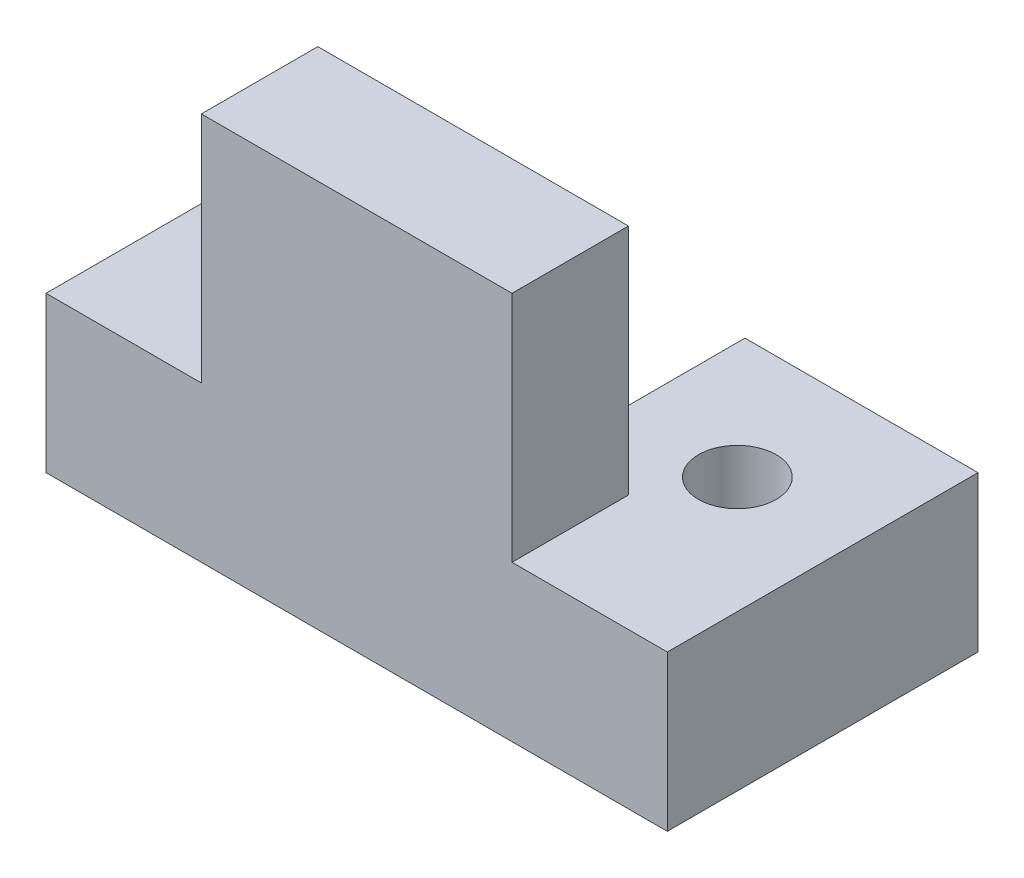
ISO-10303-21;
HEADER;
FILE_DESCRIPTION(('STEP AP214'),'2;1');
FILE_NAME('part.step','',(''),(''),'','','');
FILE_SCHEMA(('AUTOMOTIVE_DESIGN { 1 0 10303 214 1 1 1 1 }'));
ENDSEC;
DATA;
#1=APPLICATION_CONTEXT('core data for automotive mechanical design processes');
#2=APPLICATION_PROTOCOL_DEFINITION('international standard','automotive_design',2000,#1);
#3=PRODUCT_CONTEXT('',#1,'mechanical');
#4=PRODUCT('Part','Part','',(#3));
#5=PRODUCT_RELATED_PRODUCT_CATEGORY('part','',(#4));
#6=PRODUCT_DEFINITION_FORMATION('','',#4);
#7=PRODUCT_DEFINITION_CONTEXT('part definition',#1,'design');
#8=PRODUCT_DEFINITION('design','',#6,#7);
#9=PRODUCT_DEFINITION_SHAPE('','',#8);
#10=(LENGTH_UNIT() NAMED_UNIT(*) SI_UNIT(.MILLI.,.METRE.));
#11=(NAMED_UNIT(*) PLANE_ANGLE_UNIT() SI_UNIT($,.RADIAN.));
#12=(NAMED_UNIT(*) SI_UNIT($,.STERADIAN.) SOLID_ANGLE_UNIT());
#13=UNCERTAINTY_MEASURE_WITH_UNIT(LENGTH_MEASURE(1.E-05),#10,'distance_accuracy_value','');
#14=(GEOMETRIC_REPRESENTATION_CONTEXT(3) GLOBAL_UNCERTAINTY_ASSIGNED_CONTEXT((#13)) GLOBAL_UNIT_ASSIGNED_CONTEXT((#10,
#11,#12)) REPRESENTATION_CONTEXT('',''));
#15=CARTESIAN_POINT('',(0.,0.,0.));
#16=DIRECTION('',(0.,0.,1.));
#17=DIRECTION('',(1.,0.,0.));
#18=AXIS2_PLACEMENT_3D('',#15,#16,#17);
#19=CARTESIAN_POINT('',(-58.487438986932,25.4,-105.057257193932));
#20=DIRECTION('',(0.,0.,1.));
#21=DIRECTION('',(1.,0.,0.));
#22=AXIS2_PLACEMENT_3D('',#19,#20,#21);
#23=PLANE('',#22);
#24=DIRECTION('',(-1.,0.,0.));
#25=VECTOR('',#24,1.);
#26=CARTESIAN_POINT('',(-58.487438986932,0.,-105.057257193932));
#27=LINE('',#26,#25);
#28=CARTESIAN_POINT('',(43.112561013068,0.,-105.057257193932));
#29=VERTEX_POINT('',#28);
#30=CARTESIAN_POINT('',(5.01256101306804,0.,-105.057257193932));
#31=VERTEX_POINT('',#30);
#32=EDGE_CURVE('E193',#29,#31,#27,.T.);
#33=ORIENTED_EDGE('',*,*,#32,.T.);
#34=DIRECTION('',(0.,1.,0.));
#35=VECTOR('',#34,1.);
#36=CARTESIAN_POINT('',(5.01256101306804,0.,-105.057257193932));
#37=LINE('',#36,#35);
#38=CARTESIAN_POINT('',(5.01256101306804,25.4,-105.057257193932));
#39=VERTEX_POINT('',#38);
#40=EDGE_CURVE('E161',#31,#39,#37,.T.);
#41=ORIENTED_EDGE('',*,*,#40,.T.);
#42=DIRECTION('',(-1.,0.,0.));
#43=VECTOR('',#42,1.);
#44=CARTESIAN_POINT('',(-58.487438986932,25.4,-105.057257193932));
#45=LINE('',#44,#43);
#46=CARTESIAN_POINT('',(43.112561013068,25.4,-105.057257193932));
#47=VERTEX_POINT('',#46);
#48=EDGE_CURVE('E181',#47,#39,#45,.T.);
#49=ORIENTED_EDGE('',*,*,#48,.F.);
#50=DIRECTION('',(0.,-1.,0.));
#51=VECTOR('',#50,1.);
#52=CARTESIAN_POINT('',(43.112561013068,25.4,-105.057257193932));
#53=LINE('',#52,#51);
#54=EDGE_CURVE('E11',#47,#29,#53,.T.);
#55=ORIENTED_EDGE('',*,*,#54,.T.);
#56=EDGE_LOOP('',(#33,#41,#49,#55));
#57=FACE_BOUND('',#56,.T.);
#58=ADVANCED_FACE('F33',(#57),#23,.F.);
#59=CARTESIAN_POINT('',(43.112561013068,25.4,-105.057257193932));
#60=DIRECTION('',(-1.,0.,0.));
#61=DIRECTION('',(0.,0.,1.));
#62=AXIS2_PLACEMENT_3D('',#59,#60,#61);
#63=PLANE('',#62);
#64=DIRECTION('',(0.,0.,-1.));
#65=VECTOR('',#64,1.);
#66=CARTESIAN_POINT('',(43.112561013068,0.,-105.057257193932));
#67=LINE('',#66,#65);
#68=CARTESIAN_POINT('',(43.112561013068,0.,-54.2572571939323));
#69=VERTEX_POINT('',#68);
#70=EDGE_CURVE('E169',#69,#29,#67,.T.);
#71=ORIENTED_EDGE('',*,*,#70,.T.);
#72=ORIENTED_EDGE('',*,*,#54,.F.);
#73=DIRECTION('',(0.,0.,-1.));
#74=VECTOR('',#73,1.);
#75=CARTESIAN_POINT('',(43.112561013068,25.4,-105.057257193932));
#76=LINE('',#75,#74);
#77=CARTESIAN_POINT('',(43.112561013068,25.4,-54.2572571939323));
#78=VERTEX_POINT('',#77);
#79=EDGE_CURVE('E176',#78,#47,#76,.T.);
#80=ORIENTED_EDGE('',*,*,#79,.F.);
#81=DIRECTION('',(0.,-1.,0.));
#82=VECTOR('',#81,1.);
#83=CARTESIAN_POINT('',(43.112561013068,25.4,-54.2572571939323));
#84=LINE('',#83,#82);
#85=EDGE_CURVE('E189',#78,#69,#84,.T.);
#86=ORIENTED_EDGE('',*,*,#85,.T.);
#87=EDGE_LOOP('',(#71,#72,#80,#86));
#88=FACE_BOUND('',#87,.T.);
#89=ADVANCED_FACE('F35',(#88),#63,.F.);
#90=CARTESIAN_POINT('',(-20.387438986932,25.4,-105.057257193932));
#91=VERTEX_POINT('',#90);
#92=CARTESIAN_POINT('',(-58.487438986932,25.4,-105.057257193932));
#93=VERTEX_POINT('',#92);
#94=EDGE_CURVE('E179',#91,#93,#45,.T.);
#95=ORIENTED_EDGE('',*,*,#94,.F.);
#96=DIRECTION('',(0.,1.,0.));
#97=VECTOR('',#96,1.);
#98=CARTESIAN_POINT('',(-20.387438986932,0.,-105.057257193932));
#99=LINE('',#98,#97);
#100=CARTESIAN_POINT('',(-20.387438986932,0.,-105.057257193932));
#101=VERTEX_POINT('',#100);
#102=EDGE_CURVE('E172',#101,#91,#99,.T.);
#103=ORIENTED_EDGE('',*,*,#102,.F.);
#104=CARTESIAN_POINT('',(-58.487438986932,0.,-105.057257193932));
#105=VERTEX_POINT('',#104);
#106=EDGE_CURVE('E192',#101,#105,#27,.T.);
#107=ORIENTED_EDGE('',*,*,#106,.T.);
#108=DIRECTION('',(0.,-1.,0.));
#109=VECTOR('',#108,1.);
#110=CARTESIAN_POINT('',(-58.487438986932,25.4,-105.057257193932));
#111=LINE('',#110,#109);
#112=EDGE_CURVE('E41',#93,#105,#111,.T.);
#113=ORIENTED_EDGE('',*,*,#112,.F.);
#114=EDGE_LOOP('',(#95,#103,#107,#113));
#115=FACE_BOUND('',#114,.T.);
#116=ADVANCED_FACE('F248',(#115),#23,.F.);
#117=CARTESIAN_POINT('',(-58.487438986932,25.4,-105.057257193932));
#118=DIRECTION('',(1.,0.,0.));
#119=DIRECTION('',(0.,0.,-1.));
#120=AXIS2_PLACEMENT_3D('',#117,#118,#119);
#121=PLANE('',#120);
#122=DIRECTION('',(0.,0.,1.));
#123=VECTOR('',#122,1.);
#124=CARTESIAN_POINT('',(-58.487438986932,0.,-105.057257193932));
#125=LINE('',#124,#123);
#126=CARTESIAN_POINT('',(-58.487438986932,0.,-54.2572571939323));
#127=VERTEX_POINT('',#126);
#128=EDGE_CURVE('E196',#105,#127,#125,.T.);
#129=ORIENTED_EDGE('',*,*,#128,.T.);
#130=DIRECTION('',(0.,-1.,0.));
#131=VECTOR('',#130,1.);
#132=CARTESIAN_POINT('',(-58.487438986932,25.4,-54.2572571939323));
#133=LINE('',#132,#131);
#134=CARTESIAN_POINT('',(-58.487438986932,25.4,-54.2572571939323));
#135=VERTEX_POINT('',#134);
#136=EDGE_CURVE('E201',#135,#127,#133,.T.);
#137=ORIENTED_EDGE('',*,*,#136,.F.);
#138=DIRECTION('',(0.,0.,1.));
#139=VECTOR('',#138,1.);
#140=CARTESIAN_POINT('',(-58.487438986932,25.4,-105.057257193932));
#141=LINE('',#140,#139);
#142=EDGE_CURVE('E184',#93,#135,#141,.T.);
#143=ORIENTED_EDGE('',*,*,#142,.F.);
#144=ORIENTED_EDGE('',*,*,#112,.T.);
#145=EDGE_LOOP('',(#129,#137,#143,#144));
#146=FACE_BOUND('',#145,.T.);
#147=ADVANCED_FACE('F208',(#146),#121,.F.);
#148=CARTESIAN_POINT('',(-58.487438986932,25.4,-54.2572571939323));
#149=DIRECTION('',(0.,0.,-1.));
#150=DIRECTION('',(-1.,0.,0.));
#151=AXIS2_PLACEMENT_3D('',#148,#149,#150);
#152=PLANE('',#151);
#153=DIRECTION('',(1.,0.,0.));
#154=VECTOR('',#153,1.);
#155=CARTESIAN_POINT('',(-58.487438986932,0.,-54.2572571939323));
#156=LINE('',#155,#154);
#157=EDGE_CURVE('E180',#127,#69,#156,.T.);
#158=ORIENTED_EDGE('',*,*,#157,.T.);
#159=ORIENTED_EDGE('',*,*,#85,.F.);
#160=DIRECTION('',(1.,0.,0.));
#161=VECTOR('',#160,1.);
#162=CARTESIAN_POINT('',(-58.487438986932,25.4,-54.2572571939323));
#163=LINE('',#162,#161);
#164=CARTESIAN_POINT('',(17.712561013068,25.4,-54.2572571939323));
#165=VERTEX_POINT('',#164);
#166=EDGE_CURVE('E186',#165,#78,#163,.T.);
#167=ORIENTED_EDGE('',*,*,#166,.F.);
#168=DIRECTION('',(0.,-1.,0.));
#169=VECTOR('',#168,1.);
#170=CARTESIAN_POINT('',(17.712561013068,63.5,-54.2572571939323));
#171=LINE('',#170,#169);
#172=CARTESIAN_POINT('',(17.712561013068,63.5,-54.2572571939323));
#173=VERTEX_POINT('',#172);
#174=EDGE_CURVE('E128',#173,#165,#171,.T.);
#175=ORIENTED_EDGE('',*,*,#174,.F.);
#176=DIRECTION('',(1.,0.,0.));
#177=VECTOR('',#176,1.);
#178=CARTESIAN_POINT('',(-33.087438986932,63.5,-54.2572571939323));
#179=LINE('',#178,#177);
#180=CARTESIAN_POINT('',(-33.087438986932,63.5,-54.2572571939323));
#181=VERTEX_POINT('',#180);
#182=EDGE_CURVE('E121',#181,#173,#179,.T.);
#183=ORIENTED_EDGE('',*,*,#182,.F.);
#184=DIRECTION('',(0.,-1.,0.));
#185=VECTOR('',#184,1.);
#186=CARTESIAN_POINT('',(-33.087438986932,63.5,-54.2572571939323));
#187=LINE('',#186,#185);
#188=CARTESIAN_POINT('',(-33.087438986932,25.4,-54.2572571939323));
#189=VERTEX_POINT('',#188);
#190=EDGE_CURVE('E126',#181,#189,#187,.T.);
#191=ORIENTED_EDGE('',*,*,#190,.T.);
#192=EDGE_CURVE('E187',#135,#189,#163,.T.);
#193=ORIENTED_EDGE('',*,*,#192,.F.);
#194=ORIENTED_EDGE('',*,*,#136,.T.);
#195=EDGE_LOOP('',(#158,#159,#167,#175,#183,#191,#193,#194));
#196=FACE_BOUND('',#195,.T.);
#197=ADVANCED_FACE('F123',(#196),#152,.F.);
#198=CARTESIAN_POINT('',(0.,25.4,0.));
#199=DIRECTION('',(0.,1.,0.));
#200=DIRECTION('',(0.,0.,1.));
#201=AXIS2_PLACEMENT_3D('',#198,#199,#200);
#202=PLANE('',#201);
#203=CARTESIAN_POINT('',(24.062561013068,25.4,-84.7557021013472));
#204=DIRECTION('',(0.,1.,0.));
#205=DIRECTION('',(0.,0.,1.));
#206=AXIS2_PLACEMENT_3D('',#203,#204,#205);
#207=CIRCLE('',#206,6.35);
#208=CARTESIAN_POINT('',(24.062561013068,25.4,-78.4057021013472));
#209=VERTEX_POINT('',#208);
#210=EDGE_CURVE('E379',#209,#209,#207,.T.);
#211=ORIENTED_EDGE('',*,*,#210,.F.);
#212=EDGE_LOOP('',(#211));
#213=FACE_BOUND('',#212,.T.);
#214=DIRECTION('',(0.,0.,1.));
#215=VECTOR('',#214,1.);
#216=CARTESIAN_POINT('',(-33.087438986932,25.4,-73.3072571939323));
#217=LINE('',#216,#215);
#218=CARTESIAN_POINT('',(-33.087438986932,25.4,-73.3072571939323));
#219=VERTEX_POINT('',#218);
#220=EDGE_CURVE('E48',#219,#189,#217,.T.);
#221=ORIENTED_EDGE('',*,*,#220,.F.);
#222=DIRECTION('',(-1.,0.,0.));
#223=VECTOR('',#222,1.);
#224=CARTESIAN_POINT('',(-33.087438986932,25.4,-73.3072571939323));
#225=LINE('',#224,#223);
#226=CARTESIAN_POINT('',(17.712561013068,25.4,-73.3072571939323));
#227=VERTEX_POINT('',#226);
#228=EDGE_CURVE('E141',#227,#219,#225,.T.);
#229=ORIENTED_EDGE('',*,*,#228,.F.);
#230=DIRECTION('',(0.,0.,-1.));
#231=VECTOR('',#230,1.);
#232=CARTESIAN_POINT('',(17.712561013068,25.4,-73.3072571939323));
#233=LINE('',#232,#231);
#234=EDGE_CURVE('E54',#165,#227,#233,.T.);
#235=ORIENTED_EDGE('',*,*,#234,.F.);
#236=ORIENTED_EDGE('',*,*,#166,.T.);
#237=ORIENTED_EDGE('',*,*,#79,.T.);
#238=ORIENTED_EDGE('',*,*,#48,.T.);
#239=DIRECTION('',(0.,0.,-1.));
#240=VECTOR('',#239,1.);
#241=CARTESIAN_POINT('',(5.01256101306804,25.4,-105.057257193932));
#242=LINE('',#241,#240);
#243=CARTESIAN_POINT('',(5.01256101306804,25.4,-86.0072571939323));
#244=VERTEX_POINT('',#243);
#245=EDGE_CURVE('E144',#244,#39,#242,.T.);
#246=ORIENTED_EDGE('',*,*,#245,.F.);
#247=DIRECTION('',(1.,0.,0.));
#248=VECTOR('',#247,1.);
#249=CARTESIAN_POINT('',(-20.387438986932,25.4,-86.0072571939323));
#250=LINE('',#249,#248);
#251=CARTESIAN_POINT('',(-20.387438986932,25.4,-86.0072571939323));
#252=VERTEX_POINT('',#251);
#253=EDGE_CURVE('E156',#252,#244,#250,.T.);
#254=ORIENTED_EDGE('',*,*,#253,.F.);
#255=DIRECTION('',(0.,0.,1.));
#256=VECTOR('',#255,1.);
#257=CARTESIAN_POINT('',(-20.387438986932,25.4,-105.057257193932));
#258=LINE('',#257,#256);
#259=EDGE_CURVE('E146',#91,#252,#258,.T.);
#260=ORIENTED_EDGE('',*,*,#259,.F.);
#261=ORIENTED_EDGE('',*,*,#94,.T.);
#262=ORIENTED_EDGE('',*,*,#142,.T.);
#263=ORIENTED_EDGE('',*,*,#192,.T.);
#264=EDGE_LOOP('',(#221,#229,#235,#236,#237,#238,#246,#254,#260,#261,#262,#263));
#265=FACE_BOUND('',#264,.T.);
#266=ADVANCED_FACE('F221',(#213,#265),#202,.T.);
#267=CARTESIAN_POINT('',(0.,0.,0.));
#268=DIRECTION('',(0.,1.,0.));
#269=DIRECTION('',(0.,0.,1.));
#270=AXIS2_PLACEMENT_3D('',#267,#268,#269);
#271=PLANE('',#270);
#272=CARTESIAN_POINT('',(24.062561013068,0.,-84.7557021013472));
#273=DIRECTION('',(0.,1.,0.));
#274=DIRECTION('',(0.,0.,1.));
#275=AXIS2_PLACEMENT_3D('',#272,#273,#274);
#276=CIRCLE('',#275,6.35);
#277=CARTESIAN_POINT('',(24.062561013068,0.,-78.4057021013472));
#278=VERTEX_POINT('',#277);
#279=EDGE_CURVE('E232',#278,#278,#276,.T.);
#280=ORIENTED_EDGE('',*,*,#279,.T.);
#281=EDGE_LOOP('',(#280));
#282=FACE_BOUND('',#281,.T.);
#283=DIRECTION('',(1.,0.,0.));
#284=VECTOR('',#283,1.);
#285=CARTESIAN_POINT('',(-20.387438986932,0.,-86.0072571939323));
#286=LINE('',#285,#284);
#287=CARTESIAN_POINT('',(-20.387438986932,0.,-86.0072571939323));
#288=VERTEX_POINT('',#287);
#289=CARTESIAN_POINT('',(5.01256101306804,0.,-86.0072571939323));
#290=VERTEX_POINT('',#289);
#291=EDGE_CURVE('E159',#288,#290,#286,.T.);
#292=ORIENTED_EDGE('',*,*,#291,.T.);
#293=DIRECTION('',(0.,0.,-1.));
#294=VECTOR('',#293,1.);
#295=CARTESIAN_POINT('',(5.01256101306804,0.,-105.057257193932));
#296=LINE('',#295,#294);
#297=EDGE_CURVE('E152',#290,#31,#296,.T.);
#298=ORIENTED_EDGE('',*,*,#297,.T.);
#299=ORIENTED_EDGE('',*,*,#32,.F.);
#300=ORIENTED_EDGE('',*,*,#70,.F.);
#301=ORIENTED_EDGE('',*,*,#157,.F.);
#302=ORIENTED_EDGE('',*,*,#128,.F.);
#303=ORIENTED_EDGE('',*,*,#106,.F.);
#304=DIRECTION('',(0.,0.,1.));
#305=VECTOR('',#304,1.);
#306=CARTESIAN_POINT('',(-20.387438986932,0.,-105.057257193932));
#307=LINE('',#306,#305);
#308=EDGE_CURVE('E155',#101,#288,#307,.T.);
#309=ORIENTED_EDGE('',*,*,#308,.T.);
#310=EDGE_LOOP('',(#292,#298,#299,#300,#301,#302,#303,#309));
#311=FACE_BOUND('',#310,.T.);
#312=ADVANCED_FACE('F215',(#282,#311),#271,.F.);
#313=CARTESIAN_POINT('',(5.01256101306804,0.,-105.057257193932));
#314=DIRECTION('',(1.,0.,0.));
#315=DIRECTION('',(0.,0.,-1.));
#316=AXIS2_PLACEMENT_3D('',#313,#314,#315);
#317=PLANE('',#316);
#318=ORIENTED_EDGE('',*,*,#245,.T.);
#319=ORIENTED_EDGE('',*,*,#40,.F.);
#320=ORIENTED_EDGE('',*,*,#297,.F.);
#321=DIRECTION('',(0.,1.,0.));
#322=VECTOR('',#321,1.);
#323=CARTESIAN_POINT('',(5.01256101306804,0.,-86.0072571939323));
#324=LINE('',#323,#322);
#325=EDGE_CURVE('E167',#290,#244,#324,.T.);
#326=ORIENTED_EDGE('',*,*,#325,.T.);
#327=EDGE_LOOP('',(#318,#319,#320,#326));
#328=FACE_BOUND('',#327,.T.);
#329=ADVANCED_FACE('F267',(#328),#317,.F.);
#330=CARTESIAN_POINT('',(-20.387438986932,0.,-86.0072571939323));
#331=DIRECTION('',(0.,0.,1.));
#332=DIRECTION('',(1.,0.,0.));
#333=AXIS2_PLACEMENT_3D('',#330,#331,#332);
#334=PLANE('',#333);
#335=ORIENTED_EDGE('',*,*,#253,.T.);
#336=ORIENTED_EDGE('',*,*,#325,.F.);
#337=ORIENTED_EDGE('',*,*,#291,.F.);
#338=DIRECTION('',(0.,1.,0.));
#339=VECTOR('',#338,1.);
#340=CARTESIAN_POINT('',(-20.387438986932,0.,-86.0072571939323));
#341=LINE('',#340,#339);
#342=EDGE_CURVE('E170',#288,#252,#341,.T.);
#343=ORIENTED_EDGE('',*,*,#342,.T.);
#344=EDGE_LOOP('',(#335,#336,#337,#343));
#345=FACE_BOUND('',#344,.T.);
#346=ADVANCED_FACE('F265',(#345),#334,.F.);
#347=CARTESIAN_POINT('',(-20.387438986932,0.,-105.057257193932));
#348=DIRECTION('',(-1.,0.,0.));
#349=DIRECTION('',(0.,0.,1.));
#350=AXIS2_PLACEMENT_3D('',#347,#348,#349);
#351=PLANE('',#350);
#352=ORIENTED_EDGE('',*,*,#259,.T.);
#353=ORIENTED_EDGE('',*,*,#342,.F.);
#354=ORIENTED_EDGE('',*,*,#308,.F.);
#355=ORIENTED_EDGE('',*,*,#102,.T.);
#356=EDGE_LOOP('',(#352,#353,#354,#355));
#357=FACE_BOUND('',#356,.T.);
#358=ADVANCED_FACE('F262',(#357),#351,.F.);
#359=CARTESIAN_POINT('',(-33.087438986932,63.5,-73.3072571939323));
#360=DIRECTION('',(1.,0.,0.));
#361=DIRECTION('',(0.,0.,-1.));
#362=AXIS2_PLACEMENT_3D('',#359,#360,#361);
#363=PLANE('',#362);
#364=ORIENTED_EDGE('',*,*,#220,.T.);
#365=ORIENTED_EDGE('',*,*,#190,.F.);
#366=DIRECTION('',(0.,0.,1.));
#367=VECTOR('',#366,1.);
#368=CARTESIAN_POINT('',(-33.087438986932,63.5,-73.3072571939323));
#369=LINE('',#368,#367);
#370=CARTESIAN_POINT('',(-33.087438986932,63.5,-73.3072571939323));
#371=VERTEX_POINT('',#370);
#372=EDGE_CURVE('E132',#371,#181,#369,.T.);
#373=ORIENTED_EDGE('',*,*,#372,.F.);
#374=DIRECTION('',(0.,-1.,0.));
#375=VECTOR('',#374,1.);
#376=CARTESIAN_POINT('',(-33.087438986932,63.5,-73.3072571939323));
#377=LINE('',#376,#375);
#378=EDGE_CURVE('E228',#371,#219,#377,.T.);
#379=ORIENTED_EDGE('',*,*,#378,.T.);
#380=EDGE_LOOP('',(#364,#365,#373,#379));
#381=FACE_BOUND('',#380,.T.);
#382=ADVANCED_FACE('F143',(#381),#363,.F.);
#383=CARTESIAN_POINT('',(17.712561013068,63.5,-73.3072571939323));
#384=DIRECTION('',(-1.,0.,0.));
#385=DIRECTION('',(0.,0.,1.));
#386=AXIS2_PLACEMENT_3D('',#383,#384,#385);
#387=PLANE('',#386);
#388=ORIENTED_EDGE('',*,*,#234,.T.);
#389=DIRECTION('',(0.,-1.,0.));
#390=VECTOR('',#389,1.);
#391=CARTESIAN_POINT('',(17.712561013068,63.5,-73.3072571939323));
#392=LINE('',#391,#390);
#393=CARTESIAN_POINT('',(17.712561013068,63.5,-73.3072571939323));
#394=VERTEX_POINT('',#393);
#395=EDGE_CURVE('E148',#394,#227,#392,.T.);
#396=ORIENTED_EDGE('',*,*,#395,.F.);
#397=DIRECTION('',(0.,0.,-1.));
#398=VECTOR('',#397,1.);
#399=CARTESIAN_POINT('',(17.712561013068,63.5,-73.3072571939323));
#400=LINE('',#399,#398);
#401=EDGE_CURVE('E131',#173,#394,#400,.T.);
#402=ORIENTED_EDGE('',*,*,#401,.F.);
#403=ORIENTED_EDGE('',*,*,#174,.T.);
#404=EDGE_LOOP('',(#388,#396,#402,#403));
#405=FACE_BOUND('',#404,.T.);
#406=ADVANCED_FACE('F224',(#405),#387,.F.);
#407=CARTESIAN_POINT('',(-33.087438986932,63.5,-73.3072571939323));
#408=DIRECTION('',(0.,0.,1.));
#409=DIRECTION('',(1.,0.,0.));
#410=AXIS2_PLACEMENT_3D('',#407,#408,#409);
#411=PLANE('',#410);
#412=ORIENTED_EDGE('',*,*,#228,.T.);
#413=ORIENTED_EDGE('',*,*,#378,.F.);
#414=DIRECTION('',(-1.,0.,0.));
#415=VECTOR('',#414,1.);
#416=CARTESIAN_POINT('',(-33.087438986932,63.5,-73.3072571939323));
#417=LINE('',#416,#415);
#418=EDGE_CURVE('E137',#394,#371,#417,.T.);
#419=ORIENTED_EDGE('',*,*,#418,.F.);
#420=ORIENTED_EDGE('',*,*,#395,.T.);
#421=EDGE_LOOP('',(#412,#413,#419,#420));
#422=FACE_BOUND('',#421,.T.);
#423=ADVANCED_FACE('F236',(#422),#411,.F.);
#424=CARTESIAN_POINT('',(0.,63.5,0.));
#425=DIRECTION('',(0.,1.,0.));
#426=DIRECTION('',(0.,0.,1.));
#427=AXIS2_PLACEMENT_3D('',#424,#425,#426);
#428=PLANE('',#427);
#429=ORIENTED_EDGE('',*,*,#372,.T.);
#430=ORIENTED_EDGE('',*,*,#182,.T.);
#431=ORIENTED_EDGE('',*,*,#401,.T.);
#432=ORIENTED_EDGE('',*,*,#418,.T.);
#433=EDGE_LOOP('',(#429,#430,#431,#432));
#434=FACE_BOUND('',#433,.T.);
#435=ADVANCED_FACE('F135',(#434),#428,.T.);
#436=CARTESIAN_POINT('',(24.062561013068,0.,-84.7557021013472));
#437=DIRECTION('',(0.,1.,0.));
#438=DIRECTION('',(0.,0.,1.));
#439=AXIS2_PLACEMENT_3D('',#436,#437,#438);
#440=CYLINDRICAL_SURFACE('',#439,6.35);
#441=ORIENTED_EDGE('',*,*,#279,.F.);
#442=EDGE_LOOP('',(#441));
#443=FACE_BOUND('',#442,.T.);
#444=ORIENTED_EDGE('',*,*,#210,.T.);
#445=EDGE_LOOP('',(#444));
#446=FACE_BOUND('',#445,.T.);
#447=ADVANCED_FACE('F243',(#443,#446),#440,.F.);
#448=CLOSED_SHELL('',(#58,#89,#116,#147,#197,#266,#312,#329,#346,#358,#382,#406,#423,#435,#447));
#449=MANIFOLD_SOLID_BREP('B2',#448);
#450=ADVANCED_BREP_SHAPE_REPRESENTATION('',(#18,#449),#14);
#451=SHAPE_DEFINITION_REPRESENTATION(#9,#450);
ENDSEC;
END-ISO-10303-21;
